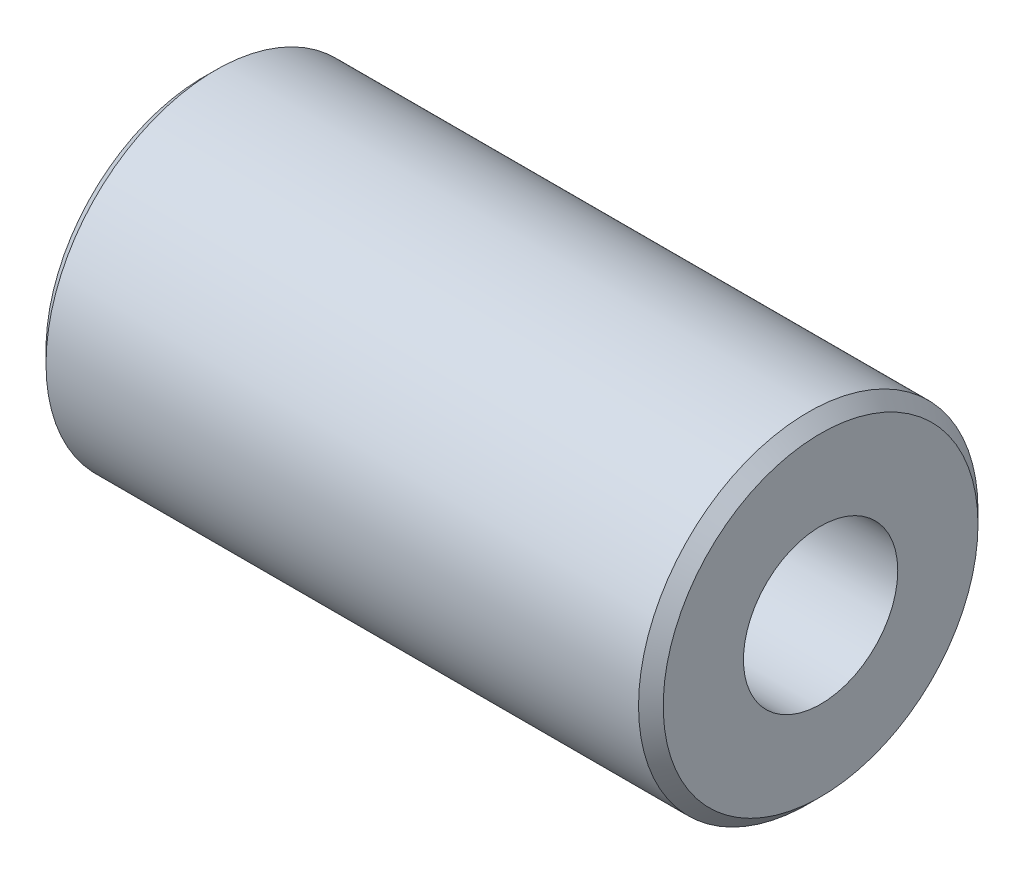
ISO-10303-21;
HEADER;
FILE_DESCRIPTION(('STEP AP214'),'2;1');
FILE_NAME('part.step','',(''),(''),'','','');
FILE_SCHEMA(('AUTOMOTIVE_DESIGN { 1 0 10303 214 1 1 1 1 }'));
ENDSEC;
DATA;
#1=APPLICATION_CONTEXT('core data for automotive mechanical design processes');
#2=APPLICATION_PROTOCOL_DEFINITION('international standard','automotive_design',2000,#1);
#3=PRODUCT_CONTEXT('',#1,'mechanical');
#4=PRODUCT('Part','Part','',(#3));
#5=PRODUCT_RELATED_PRODUCT_CATEGORY('part','',(#4));
#6=PRODUCT_DEFINITION_FORMATION('','',#4);
#7=PRODUCT_DEFINITION_CONTEXT('part definition',#1,'design');
#8=PRODUCT_DEFINITION('design','',#6,#7);
#9=PRODUCT_DEFINITION_SHAPE('','',#8);
#10=(LENGTH_UNIT() NAMED_UNIT(*) SI_UNIT(.MILLI.,.METRE.));
#11=(NAMED_UNIT(*) PLANE_ANGLE_UNIT() SI_UNIT($,.RADIAN.));
#12=(NAMED_UNIT(*) SI_UNIT($,.STERADIAN.) SOLID_ANGLE_UNIT());
#13=UNCERTAINTY_MEASURE_WITH_UNIT(LENGTH_MEASURE(1.E-05),#10,'distance_accuracy_value','');
#14=(GEOMETRIC_REPRESENTATION_CONTEXT(3) GLOBAL_UNCERTAINTY_ASSIGNED_CONTEXT((#13)) GLOBAL_UNIT_ASSIGNED_CONTEXT((#10,
#11,#12)) REPRESENTATION_CONTEXT('',''));
#15=CARTESIAN_POINT('',(0.,0.,0.));
#16=DIRECTION('',(0.,0.,1.));
#17=DIRECTION('',(1.,0.,0.));
#18=AXIS2_PLACEMENT_3D('',#15,#16,#17);
#19=CARTESIAN_POINT('',(5.,0.,0.));
#20=DIRECTION('',(-1.,0.,0.));
#21=DIRECTION('',(0.,0.,1.));
#22=AXIS2_PLACEMENT_3D('',#19,#20,#21);
#23=CYLINDRICAL_SURFACE('',#22,2.75);
#24=CARTESIAN_POINT('',(4.8,0.,0.));
#25=DIRECTION('',(1.,0.,0.));
#26=DIRECTION('',(0.,0.,-1.));
#27=AXIS2_PLACEMENT_3D('',#24,#25,#26);
#28=CIRCLE('',#27,2.75);
#29=CARTESIAN_POINT('',(4.8,0.,-2.75));
#30=VERTEX_POINT('',#29);
#31=EDGE_CURVE('E55',#30,#30,#28,.F.);
#32=ORIENTED_EDGE('',*,*,#31,.T.);
#33=EDGE_LOOP('',(#32));
#34=FACE_BOUND('',#33,.T.);
#35=CARTESIAN_POINT('',(-4.8,0.,0.));
#36=DIRECTION('',(1.,0.,0.));
#37=DIRECTION('',(0.,0.,-1.));
#38=AXIS2_PLACEMENT_3D('',#35,#36,#37);
#39=CIRCLE('',#38,2.75);
#40=CARTESIAN_POINT('',(-4.8,0.,-2.75));
#41=VERTEX_POINT('',#40);
#42=EDGE_CURVE('E71',#41,#41,#39,.T.);
#43=ORIENTED_EDGE('',*,*,#42,.T.);
#44=EDGE_LOOP('',(#43));
#45=FACE_BOUND('',#44,.T.);
#46=ADVANCED_FACE('F47',(#34,#45),#23,.T.);
#47=CARTESIAN_POINT('',(5.,0.,0.));
#48=DIRECTION('',(1.,0.,0.));
#49=DIRECTION('',(0.,0.,-1.));
#50=AXIS2_PLACEMENT_3D('',#47,#48,#49);
#51=PLANE('',#50);
#52=CARTESIAN_POINT('',(5.,0.,0.));
#53=DIRECTION('',(1.,0.,0.));
#54=DIRECTION('',(0.,0.,-1.));
#55=AXIS2_PLACEMENT_3D('',#52,#53,#54);
#56=CIRCLE('',#55,1.24999999999999);
#57=CARTESIAN_POINT('',(5.,0.,-1.24999999999999));
#58=VERTEX_POINT('',#57);
#59=EDGE_CURVE('E68',#58,#58,#56,.T.);
#60=ORIENTED_EDGE('',*,*,#59,.F.);
#61=EDGE_LOOP('',(#60));
#62=FACE_BOUND('',#61,.T.);
#63=CARTESIAN_POINT('',(5.,0.,0.));
#64=DIRECTION('',(1.,0.,0.));
#65=DIRECTION('',(0.,0.,-1.));
#66=AXIS2_PLACEMENT_3D('',#63,#64,#65);
#67=CIRCLE('',#66,2.55);
#68=CARTESIAN_POINT('',(5.,0.,-2.55));
#69=VERTEX_POINT('',#68);
#70=EDGE_CURVE('E67',#69,#69,#67,.T.);
#71=ORIENTED_EDGE('',*,*,#70,.T.);
#72=EDGE_LOOP('',(#71));
#73=FACE_BOUND('',#72,.T.);
#74=ADVANCED_FACE('F88',(#62,#73),#51,.T.);
#75=CARTESIAN_POINT('',(-5.,0.,0.));
#76=DIRECTION('',(1.,0.,0.));
#77=DIRECTION('',(0.,0.,-1.));
#78=AXIS2_PLACEMENT_3D('',#75,#76,#77);
#79=PLANE('',#78);
#80=CARTESIAN_POINT('',(-5.,0.,0.));
#81=DIRECTION('',(1.,0.,0.));
#82=DIRECTION('',(0.,0.,-1.));
#83=AXIS2_PLACEMENT_3D('',#80,#81,#82);
#84=CIRCLE('',#83,2.55);
#85=CARTESIAN_POINT('',(-5.,0.,-2.55));
#86=VERTEX_POINT('',#85);
#87=EDGE_CURVE('E11',#86,#86,#84,.F.);
#88=ORIENTED_EDGE('',*,*,#87,.T.);
#89=EDGE_LOOP('',(#88));
#90=FACE_BOUND('',#89,.T.);
#91=ADVANCED_FACE('F85',(#90),#79,.F.);
#92=CARTESIAN_POINT('',(5.,0.,0.));
#93=DIRECTION('',(-1.,0.,0.));
#94=DIRECTION('',(0.,0.,1.));
#95=AXIS2_PLACEMENT_3D('',#92,#93,#94);
#96=CONICAL_SURFACE('',#95,2.55,0.785398163397446);
#97=ORIENTED_EDGE('',*,*,#31,.F.);
#98=EDGE_LOOP('',(#97));
#99=FACE_BOUND('',#98,.T.);
#100=ORIENTED_EDGE('',*,*,#70,.F.);
#101=EDGE_LOOP('',(#100));
#102=FACE_BOUND('',#101,.T.);
#103=ADVANCED_FACE('F82',(#99,#102),#96,.T.);
#104=CARTESIAN_POINT('',(-4.8,0.,0.));
#105=DIRECTION('',(1.,0.,0.));
#106=DIRECTION('',(0.,0.,-1.));
#107=AXIS2_PLACEMENT_3D('',#104,#105,#106);
#108=CONICAL_SURFACE('',#107,2.75,0.785398163397446);
#109=ORIENTED_EDGE('',*,*,#87,.F.);
#110=EDGE_LOOP('',(#109));
#111=FACE_BOUND('',#110,.T.);
#112=ORIENTED_EDGE('',*,*,#42,.F.);
#113=EDGE_LOOP('',(#112));
#114=FACE_BOUND('',#113,.T.);
#115=ADVANCED_FACE('F50',(#111,#114),#108,.T.);
#116=CARTESIAN_POINT('',(-2.50000000000001,0.,0.));
#117=DIRECTION('',(1.,0.,0.));
#118=DIRECTION('',(0.,0.,-1.));
#119=AXIS2_PLACEMENT_3D('',#116,#117,#118);
#120=CONICAL_SURFACE('',#119,1.24999999999999,1.02974425867665);
#121=CARTESIAN_POINT('',(-3.25107577378445,0.,0.));
#122=VERTEX_POINT('',#121);
#123=VERTEX_LOOP('',#122);
#124=FACE_BOUND('',#123,.T.);
#125=CARTESIAN_POINT('',(-2.50000000000001,0.,0.));
#126=DIRECTION('',(1.,0.,0.));
#127=DIRECTION('',(0.,0.,-1.));
#128=AXIS2_PLACEMENT_3D('',#125,#126,#127);
#129=CIRCLE('',#128,1.24999999999999);
#130=CARTESIAN_POINT('',(-2.50000000000001,0.,-1.24999999999999));
#131=VERTEX_POINT('',#130);
#132=EDGE_CURVE('E65',#131,#131,#129,.T.);
#133=ORIENTED_EDGE('',*,*,#132,.T.);
#134=EDGE_LOOP('',(#133));
#135=FACE_BOUND('',#134,.T.);
#136=ADVANCED_FACE('F58',(#124,#135),#120,.F.);
#137=CARTESIAN_POINT('',(5.,0.,0.));
#138=DIRECTION('',(1.,0.,0.));
#139=DIRECTION('',(0.,0.,-1.));
#140=AXIS2_PLACEMENT_3D('',#137,#138,#139);
#141=CYLINDRICAL_SURFACE('',#140,1.24999999999999);
#142=ORIENTED_EDGE('',*,*,#132,.F.);
#143=EDGE_LOOP('',(#142));
#144=FACE_BOUND('',#143,.T.);
#145=ORIENTED_EDGE('',*,*,#59,.T.);
#146=EDGE_LOOP('',(#145));
#147=FACE_BOUND('',#146,.T.);
#148=ADVANCED_FACE('F61',(#144,#147),#141,.F.);
#149=CLOSED_SHELL('',(#46,#74,#91,#103,#115,#136,#148));
#150=MANIFOLD_SOLID_BREP('B2',#149);
#151=ADVANCED_BREP_SHAPE_REPRESENTATION('',(#18,#150),#14);
#152=SHAPE_DEFINITION_REPRESENTATION(#9,#151);
ENDSEC;
END-ISO-10303-21;
